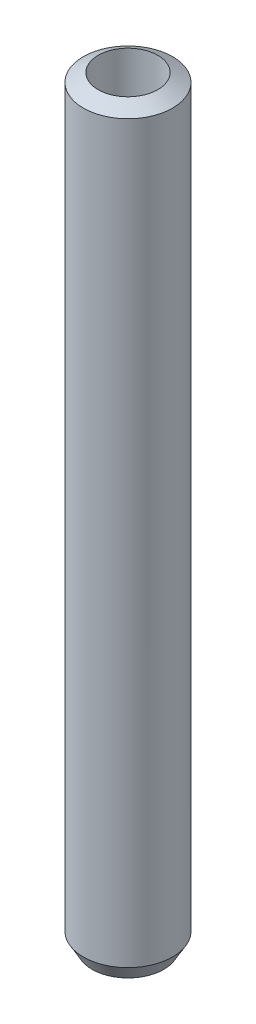
ISO-10303-21;
HEADER;
FILE_DESCRIPTION(('STEP AP214'),'2;1');
FILE_NAME('part.step','',(''),(''),'','','');
FILE_SCHEMA(('AUTOMOTIVE_DESIGN { 1 0 10303 214 1 1 1 1 }'));
ENDSEC;
DATA;
#1=APPLICATION_CONTEXT('core data for automotive mechanical design processes');
#2=APPLICATION_PROTOCOL_DEFINITION('international standard','automotive_design',2000,#1);
#3=PRODUCT_CONTEXT('',#1,'mechanical');
#4=PRODUCT('Part','Part','',(#3));
#5=PRODUCT_RELATED_PRODUCT_CATEGORY('part','',(#4));
#6=PRODUCT_DEFINITION_FORMATION('','',#4);
#7=PRODUCT_DEFINITION_CONTEXT('part definition',#1,'design');
#8=PRODUCT_DEFINITION('design','',#6,#7);
#9=PRODUCT_DEFINITION_SHAPE('','',#8);
#10=(LENGTH_UNIT() NAMED_UNIT(*) SI_UNIT(.MILLI.,.METRE.));
#11=(NAMED_UNIT(*) PLANE_ANGLE_UNIT() SI_UNIT($,.RADIAN.));
#12=(NAMED_UNIT(*) SI_UNIT($,.STERADIAN.) SOLID_ANGLE_UNIT());
#13=UNCERTAINTY_MEASURE_WITH_UNIT(LENGTH_MEASURE(1.E-05),#10,'distance_accuracy_value','');
#14=(GEOMETRIC_REPRESENTATION_CONTEXT(3) GLOBAL_UNCERTAINTY_ASSIGNED_CONTEXT((#13)) GLOBAL_UNIT_ASSIGNED_CONTEXT((#10,
#11,#12)) REPRESENTATION_CONTEXT('',''));
#15=CARTESIAN_POINT('',(0.,0.,0.));
#16=DIRECTION('',(0.,0.,1.));
#17=DIRECTION('',(1.,0.,0.));
#18=AXIS2_PLACEMENT_3D('',#15,#16,#17);
#19=CARTESIAN_POINT('',(0.,255.247167718904,0.));
#20=DIRECTION('',(0.,-1.,0.));
#21=DIRECTION('',(0.,0.,-1.));
#22=AXIS2_PLACEMENT_3D('',#19,#20,#21);
#23=CYLINDRICAL_SURFACE('',#22,15.);
#24=CARTESIAN_POINT('',(0.,252.308670041445,0.));
#25=DIRECTION('',(0.,1.,0.));
#26=DIRECTION('',(0.,0.,1.));
#27=AXIS2_PLACEMENT_3D('',#24,#25,#26);
#28=CIRCLE('',#27,15.);
#29=CARTESIAN_POINT('',(0.,252.308670041445,15.));
#30=VERTEX_POINT('',#29);
#31=EDGE_CURVE('E50',#30,#30,#28,.F.);
#32=ORIENTED_EDGE('',*,*,#31,.T.);
#33=EDGE_LOOP('',(#32));
#34=FACE_BOUND('',#33,.T.);
#35=CARTESIAN_POINT('',(0.,5.08962727528195,0.));
#36=DIRECTION('',(0.,1.,0.));
#37=DIRECTION('',(0.,0.,1.));
#38=AXIS2_PLACEMENT_3D('',#35,#36,#37);
#39=CIRCLE('',#38,15.);
#40=CARTESIAN_POINT('',(0.,5.08962727528195,15.));
#41=VERTEX_POINT('',#40);
#42=EDGE_CURVE('E51',#41,#41,#39,.T.);
#43=ORIENTED_EDGE('',*,*,#42,.T.);
#44=EDGE_LOOP('',(#43));
#45=FACE_BOUND('',#44,.T.);
#46=ADVANCED_FACE('F39',(#34,#45),#23,.T.);
#47=CARTESIAN_POINT('',(0.,0.,0.));
#48=DIRECTION('',(0.,1.,0.));
#49=DIRECTION('',(0.,0.,1.));
#50=AXIS2_PLACEMENT_3D('',#47,#48,#49);
#51=PLANE('',#50);
#52=CARTESIAN_POINT('',(0.,0.,0.));
#53=DIRECTION('',(0.,1.,0.));
#54=DIRECTION('',(0.,0.,1.));
#55=AXIS2_PLACEMENT_3D('',#52,#53,#54);
#56=CIRCLE('',#55,12.0615023225411);
#57=CARTESIAN_POINT('',(0.,0.,12.0615023225411));
#58=VERTEX_POINT('',#57);
#59=EDGE_CURVE('E10',#58,#58,#56,.F.);
#60=ORIENTED_EDGE('',*,*,#59,.T.);
#61=EDGE_LOOP('',(#60));
#62=FACE_BOUND('',#61,.T.);
#63=CARTESIAN_POINT('',(0.,0.,0.));
#64=DIRECTION('',(0.,1.,0.));
#65=DIRECTION('',(0.,0.,1.));
#66=AXIS2_PLACEMENT_3D('',#63,#64,#65);
#67=CIRCLE('',#66,10.0218246177706);
#68=CARTESIAN_POINT('',(0.,0.,10.0218246177706));
#69=VERTEX_POINT('',#68);
#70=EDGE_CURVE('E58',#69,#69,#67,.T.);
#71=ORIENTED_EDGE('',*,*,#70,.T.);
#72=EDGE_LOOP('',(#71));
#73=FACE_BOUND('',#72,.T.);
#74=ADVANCED_FACE('F62',(#62,#73),#51,.F.);
#75=CARTESIAN_POINT('',(0.,255.247167718904,0.));
#76=DIRECTION('',(0.,-1.,0.));
#77=DIRECTION('',(0.,0.,-1.));
#78=AXIS2_PLACEMENT_3D('',#75,#76,#77);
#79=CYLINDRICAL_SURFACE('',#78,10.0218246177706);
#80=CARTESIAN_POINT('',(0.,255.182820938448,0.));
#81=DIRECTION('',(0.,-1.,0.));
#82=DIRECTION('',(0.,0.,-1.));
#83=AXIS2_PLACEMENT_3D('',#80,#81,#82);
#84=CIRCLE('',#83,10.0218246177706);
#85=CARTESIAN_POINT('',(0.,255.182820938448,-10.0218246177706));
#86=VERTEX_POINT('',#85);
#87=EDGE_CURVE('E54',#86,#86,#84,.F.);
#88=ORIENTED_EDGE('',*,*,#87,.T.);
#89=EDGE_LOOP('',(#88));
#90=FACE_BOUND('',#89,.T.);
#91=ORIENTED_EDGE('',*,*,#70,.F.);
#92=EDGE_LOOP('',(#91));
#93=FACE_BOUND('',#92,.T.);
#94=ADVANCED_FACE('F68',(#90,#93),#79,.F.);
#95=CARTESIAN_POINT('',(0.,255.247167718904,0.));
#96=DIRECTION('',(0.,-1.,0.));
#97=DIRECTION('',(0.,0.,-1.));
#98=AXIS2_PLACEMENT_3D('',#95,#96,#97);
#99=CONICAL_SURFACE('',#98,9.91037272471788,1.0471975511966);
#100=ORIENTED_EDGE('',*,*,#31,.F.);
#101=EDGE_LOOP('',(#100));
#102=FACE_BOUND('',#101,.T.);
#103=ORIENTED_EDGE('',*,*,#87,.F.);
#104=EDGE_LOOP('',(#103));
#105=FACE_BOUND('',#104,.T.);
#106=ADVANCED_FACE('F66',(#102,#105),#99,.T.);
#107=CARTESIAN_POINT('',(0.,5.08962727528195,0.));
#108=DIRECTION('',(0.,1.,0.));
#109=DIRECTION('',(0.,0.,1.));
#110=AXIS2_PLACEMENT_3D('',#107,#108,#109);
#111=CONICAL_SURFACE('',#110,15.,0.523598775598303);
#112=ORIENTED_EDGE('',*,*,#59,.F.);
#113=EDGE_LOOP('',(#112));
#114=FACE_BOUND('',#113,.T.);
#115=ORIENTED_EDGE('',*,*,#42,.F.);
#116=EDGE_LOOP('',(#115));
#117=FACE_BOUND('',#116,.T.);
#118=ADVANCED_FACE('F45',(#114,#117),#111,.T.);
#119=CLOSED_SHELL('',(#46,#74,#94,#106,#118));
#120=MANIFOLD_SOLID_BREP('B2',#119);
#121=ADVANCED_BREP_SHAPE_REPRESENTATION('',(#18,#120),#14);
#122=SHAPE_DEFINITION_REPRESENTATION(#9,#121);
ENDSEC;
END-ISO-10303-21;
